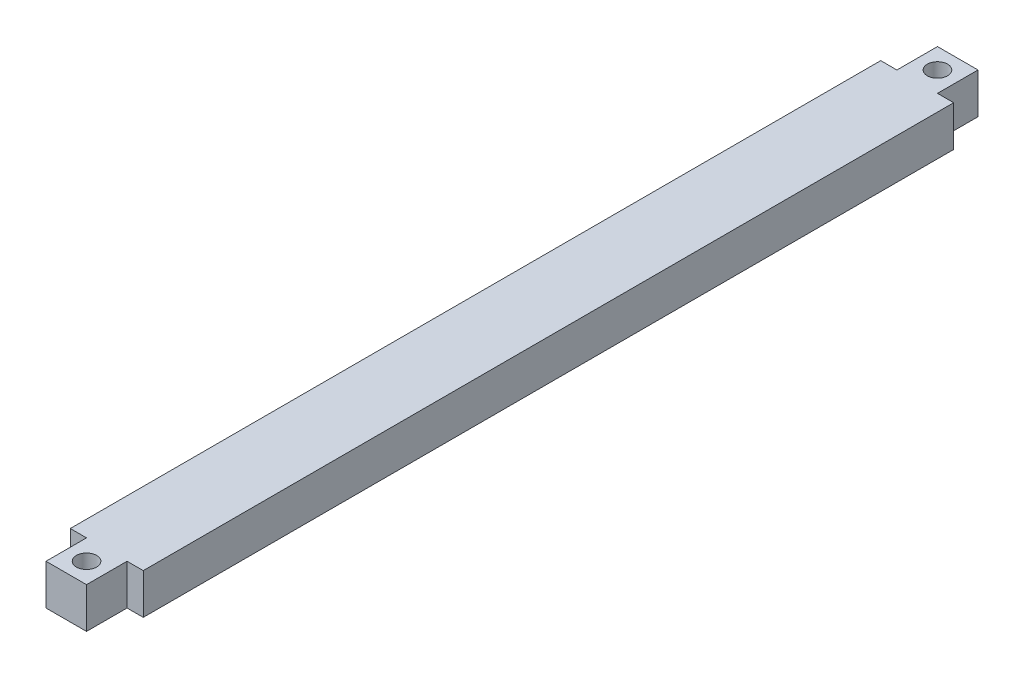
ISO-10303-21;
HEADER;
FILE_DESCRIPTION(('STEP AP214'),'2;1');
FILE_NAME('part.step','',(''),(''),'','','');
FILE_SCHEMA(('AUTOMOTIVE_DESIGN { 1 0 10303 214 1 1 1 1 }'));
ENDSEC;
DATA;
#1=APPLICATION_CONTEXT('core data for automotive mechanical design processes');
#2=APPLICATION_PROTOCOL_DEFINITION('international standard','automotive_design',2000,#1);
#3=PRODUCT_CONTEXT('',#1,'mechanical');
#4=PRODUCT('Part','Part','',(#3));
#5=PRODUCT_RELATED_PRODUCT_CATEGORY('part','',(#4));
#6=PRODUCT_DEFINITION_FORMATION('','',#4);
#7=PRODUCT_DEFINITION_CONTEXT('part definition',#1,'design');
#8=PRODUCT_DEFINITION('design','',#6,#7);
#9=PRODUCT_DEFINITION_SHAPE('','',#8);
#10=(LENGTH_UNIT() NAMED_UNIT(*) SI_UNIT(.MILLI.,.METRE.));
#11=(NAMED_UNIT(*) PLANE_ANGLE_UNIT() SI_UNIT($,.RADIAN.));
#12=(NAMED_UNIT(*) SI_UNIT($,.STERADIAN.) SOLID_ANGLE_UNIT());
#13=UNCERTAINTY_MEASURE_WITH_UNIT(LENGTH_MEASURE(1.E-05),#10,'distance_accuracy_value','');
#14=(GEOMETRIC_REPRESENTATION_CONTEXT(3) GLOBAL_UNCERTAINTY_ASSIGNED_CONTEXT((#13)) GLOBAL_UNIT_ASSIGNED_CONTEXT((#10,
#11,#12)) REPRESENTATION_CONTEXT('',''));
#15=CARTESIAN_POINT('',(0.,0.,0.));
#16=DIRECTION('',(0.,0.,1.));
#17=DIRECTION('',(1.,0.,0.));
#18=AXIS2_PLACEMENT_3D('',#15,#16,#17);
#19=CARTESIAN_POINT('',(0.438510718435152,1.01292157270844,110.));
#20=DIRECTION('',(0.,-1.,0.));
#21=DIRECTION('',(0.,0.,-1.));
#22=AXIS2_PLACEMENT_3D('',#19,#20,#21);
#23=PLANE('',#22);
#24=DIRECTION('',(-1.,0.,0.));
#25=VECTOR('',#24,1.);
#26=CARTESIAN_POINT('',(0.438510718435152,1.01292157270844,0.));
#27=LINE('',#26,#25);
#28=CARTESIAN_POINT('',(5.43851071843515,1.01292157270844,0.));
#29=VERTEX_POINT('',#28);
#30=CARTESIAN_POINT('',(0.438510718435152,1.01292157270844,0.));
#31=VERTEX_POINT('',#30);
#32=EDGE_CURVE('E209',#29,#31,#27,.T.);
#33=ORIENTED_EDGE('',*,*,#32,.T.);
#34=DIRECTION('',(0.,0.,-1.));
#35=VECTOR('',#34,1.);
#36=CARTESIAN_POINT('',(0.438510718435152,1.01292157270844,110.));
#37=LINE('',#36,#35);
#38=CARTESIAN_POINT('',(0.438510718435152,1.01292157270844,5.00908916910703));
#39=VERTEX_POINT('',#38);
#40=EDGE_CURVE('E213',#39,#31,#37,.T.);
#41=ORIENTED_EDGE('',*,*,#40,.F.);
#42=DIRECTION('',(-0.999989673535574,0.,-0.00454453762400342));
#43=VECTOR('',#42,1.);
#44=CARTESIAN_POINT('',(0.438510718435152,1.01292157270844,5.00908916910703));
#45=LINE('',#44,#43);
#46=CARTESIAN_POINT('',(-1.56148928156485,1.01292157270844,5.00000000000004));
#47=VERTEX_POINT('',#46);
#48=EDGE_CURVE('E50',#39,#47,#45,.T.);
#49=ORIENTED_EDGE('',*,*,#48,.T.);
#50=DIRECTION('',(0.,0.,1.));
#51=VECTOR('',#50,1.);
#52=CARTESIAN_POINT('',(-1.56148928156485,1.01292157270844,5.00000000000004));
#53=LINE('',#52,#51);
#54=CARTESIAN_POINT('',(-1.56148928156484,1.01292157270844,105.));
#55=VERTEX_POINT('',#54);
#56=EDGE_CURVE('E129',#47,#55,#53,.T.);
#57=ORIENTED_EDGE('',*,*,#56,.T.);
#58=DIRECTION('',(1.,0.,0.));
#59=VECTOR('',#58,1.);
#60=CARTESIAN_POINT('',(-1.56148928156484,1.01292157270844,105.));
#61=LINE('',#60,#59);
#62=CARTESIAN_POINT('',(0.438510718435152,1.01292157270844,105.));
#63=VERTEX_POINT('',#62);
#64=EDGE_CURVE('E144',#55,#63,#61,.T.);
#65=ORIENTED_EDGE('',*,*,#64,.T.);
#66=CARTESIAN_POINT('',(0.438510718435152,1.01292157270844,110.));
#67=VERTEX_POINT('',#66);
#68=EDGE_CURVE('E215',#67,#63,#37,.T.);
#69=ORIENTED_EDGE('',*,*,#68,.F.);
#70=DIRECTION('',(-1.,0.,0.));
#71=VECTOR('',#70,1.);
#72=CARTESIAN_POINT('',(0.438510718435152,1.01292157270844,110.));
#73=LINE('',#72,#71);
#74=CARTESIAN_POINT('',(5.43851071843515,1.01292157270844,110.));
#75=VERTEX_POINT('',#74);
#76=EDGE_CURVE('E221',#75,#67,#73,.T.);
#77=ORIENTED_EDGE('',*,*,#76,.F.);
#78=DIRECTION('',(0.,0.,-1.));
#79=VECTOR('',#78,1.);
#80=CARTESIAN_POINT('',(5.43851071843515,1.01292157270844,110.));
#81=LINE('',#80,#79);
#82=CARTESIAN_POINT('',(5.43851071843515,1.01292157270844,105.));
#83=VERTEX_POINT('',#82);
#84=EDGE_CURVE('E197',#75,#83,#81,.T.);
#85=ORIENTED_EDGE('',*,*,#84,.T.);
#86=DIRECTION('',(1.,0.,0.));
#87=VECTOR('',#86,1.);
#88=CARTESIAN_POINT('',(7.43851071843516,1.01292157270844,105.));
#89=LINE('',#88,#87);
#90=CARTESIAN_POINT('',(7.43851071843516,1.01292157270844,105.));
#91=VERTEX_POINT('',#90);
#92=EDGE_CURVE('E58',#83,#91,#89,.T.);
#93=ORIENTED_EDGE('',*,*,#92,.T.);
#94=DIRECTION('',(0.,0.,-1.));
#95=VECTOR('',#94,1.);
#96=CARTESIAN_POINT('',(7.43851071843515,1.01292157270844,5.00000000000004));
#97=LINE('',#96,#95);
#98=CARTESIAN_POINT('',(7.43851071843515,1.01292157270844,5.00000000000004));
#99=VERTEX_POINT('',#98);
#100=EDGE_CURVE('E167',#91,#99,#97,.T.);
#101=ORIENTED_EDGE('',*,*,#100,.T.);
#102=DIRECTION('',(-1.,0.,0.));
#103=VECTOR('',#102,1.);
#104=CARTESIAN_POINT('',(5.43851071843515,1.01292157270844,5.00000000000004));
#105=LINE('',#104,#103);
#106=CARTESIAN_POINT('',(5.43851071843515,1.01292157270844,5.00000000000004));
#107=VERTEX_POINT('',#106);
#108=EDGE_CURVE('E170',#99,#107,#105,.T.);
#109=ORIENTED_EDGE('',*,*,#108,.T.);
#110=EDGE_CURVE('E202',#107,#29,#81,.T.);
#111=ORIENTED_EDGE('',*,*,#110,.T.);
#112=EDGE_LOOP('',(#33,#41,#49,#57,#65,#69,#77,#85,#93,#101,#109,#111));
#113=FACE_BOUND('',#112,.T.);
#114=CARTESIAN_POINT('',(2.93851071843515,1.01292157270844,2.50227229227677));
#115=DIRECTION('',(0.,1.,0.));
#116=DIRECTION('',(0.,0.,1.));
#117=AXIS2_PLACEMENT_3D('',#114,#115,#116);
#118=CIRCLE('',#117,1.24999999999999);
#119=CARTESIAN_POINT('',(2.93851071843515,1.01292157270844,3.75227229227676));
#120=VERTEX_POINT('',#119);
#121=EDGE_CURVE('E272',#120,#120,#118,.T.);
#122=ORIENTED_EDGE('',*,*,#121,.F.);
#123=EDGE_LOOP('',(#122));
#124=FACE_BOUND('',#123,.T.);
#125=CARTESIAN_POINT('',(2.93851071843507,1.01292157270844,107.497727707723));
#126=DIRECTION('',(0.,1.,0.));
#127=DIRECTION('',(0.,0.,1.));
#128=AXIS2_PLACEMENT_3D('',#125,#126,#127);
#129=CIRCLE('',#128,1.24999999999999);
#130=CARTESIAN_POINT('',(2.93851071843507,1.01292157270844,108.747727707723));
#131=VERTEX_POINT('',#130);
#132=EDGE_CURVE('E283',#131,#131,#129,.T.);
#133=ORIENTED_EDGE('',*,*,#132,.F.);
#134=EDGE_LOOP('',(#133));
#135=FACE_BOUND('',#134,.T.);
#136=ADVANCED_FACE('F33',(#113,#124,#135),#23,.F.);
#137=CARTESIAN_POINT('',(0.438510718435152,1.01292157270844,110.));
#138=DIRECTION('',(1.,0.,0.));
#139=DIRECTION('',(0.,1.,0.));
#140=AXIS2_PLACEMENT_3D('',#137,#138,#139);
#141=PLANE('',#140);
#142=DIRECTION('',(0.,1.,0.));
#143=VECTOR('',#142,1.);
#144=CARTESIAN_POINT('',(0.438510718435152,-3.98707842729156,105.));
#145=LINE('',#144,#143);
#146=CARTESIAN_POINT('',(0.438510718435152,-3.98707842729156,105.));
#147=VERTEX_POINT('',#146);
#148=EDGE_CURVE('E153',#147,#63,#145,.T.);
#149=ORIENTED_EDGE('',*,*,#148,.F.);
#150=DIRECTION('',(0.,0.,-1.));
#151=VECTOR('',#150,1.);
#152=CARTESIAN_POINT('',(0.438510718435152,-3.98707842729156,110.));
#153=LINE('',#152,#151);
#154=CARTESIAN_POINT('',(0.438510718435152,-3.98707842729156,110.));
#155=VERTEX_POINT('',#154);
#156=EDGE_CURVE('E11',#155,#147,#153,.T.);
#157=ORIENTED_EDGE('',*,*,#156,.F.);
#158=DIRECTION('',(0.,-1.,0.));
#159=VECTOR('',#158,1.);
#160=CARTESIAN_POINT('',(0.438510718435152,1.01292157270844,110.));
#161=LINE('',#160,#159);
#162=EDGE_CURVE('E243',#67,#155,#161,.T.);
#163=ORIENTED_EDGE('',*,*,#162,.F.);
#164=ORIENTED_EDGE('',*,*,#68,.T.);
#165=EDGE_LOOP('',(#149,#157,#163,#164));
#166=FACE_BOUND('',#165,.T.);
#167=ADVANCED_FACE('F291',(#166),#141,.F.);
#168=CARTESIAN_POINT('',(5.43851071843515,1.01292157270844,110.));
#169=DIRECTION('',(-1.,0.,0.));
#170=DIRECTION('',(0.,0.,1.));
#171=AXIS2_PLACEMENT_3D('',#168,#169,#170);
#172=PLANE('',#171);
#173=DIRECTION('',(0.,1.,0.));
#174=VECTOR('',#173,1.);
#175=CARTESIAN_POINT('',(5.43851071843515,-3.98707842729156,5.00000000000004));
#176=LINE('',#175,#174);
#177=CARTESIAN_POINT('',(5.43851071843515,-3.98707842729156,5.00000000000004));
#178=VERTEX_POINT('',#177);
#179=EDGE_CURVE('E176',#178,#107,#176,.T.);
#180=ORIENTED_EDGE('',*,*,#179,.F.);
#181=DIRECTION('',(0.,0.,-1.));
#182=VECTOR('',#181,1.);
#183=CARTESIAN_POINT('',(5.43851071843515,-3.98707842729156,110.));
#184=LINE('',#183,#182);
#185=CARTESIAN_POINT('',(5.43851071843515,-3.98707842729156,0.));
#186=VERTEX_POINT('',#185);
#187=EDGE_CURVE('E201',#178,#186,#184,.T.);
#188=ORIENTED_EDGE('',*,*,#187,.T.);
#189=DIRECTION('',(0.,1.,0.));
#190=VECTOR('',#189,1.);
#191=CARTESIAN_POINT('',(5.43851071843515,1.01292157270844,0.));
#192=LINE('',#191,#190);
#193=EDGE_CURVE('E237',#186,#29,#192,.T.);
#194=ORIENTED_EDGE('',*,*,#193,.T.);
#195=ORIENTED_EDGE('',*,*,#110,.F.);
#196=EDGE_LOOP('',(#180,#188,#194,#195));
#197=FACE_BOUND('',#196,.T.);
#198=ADVANCED_FACE('F298',(#197),#172,.F.);
#199=CARTESIAN_POINT('',(0.438510718435152,-3.98707842729156,5.00908916910703));
#200=VERTEX_POINT('',#199);
#201=CARTESIAN_POINT('',(0.438510718435152,-3.98707842729156,0.));
#202=VERTEX_POINT('',#201);
#203=EDGE_CURVE('E42',#200,#202,#153,.T.);
#204=ORIENTED_EDGE('',*,*,#203,.F.);
#205=DIRECTION('',(0.,1.,0.));
#206=VECTOR('',#205,1.);
#207=CARTESIAN_POINT('',(0.438510718435152,-3.98707842729156,5.00908916910703));
#208=LINE('',#207,#206);
#209=EDGE_CURVE('E143',#200,#39,#208,.T.);
#210=ORIENTED_EDGE('',*,*,#209,.T.);
#211=ORIENTED_EDGE('',*,*,#40,.T.);
#212=DIRECTION('',(0.,-1.,0.));
#213=VECTOR('',#212,1.);
#214=CARTESIAN_POINT('',(0.438510718435152,1.01292157270844,0.));
#215=LINE('',#214,#213);
#216=EDGE_CURVE('E179',#31,#202,#215,.T.);
#217=ORIENTED_EDGE('',*,*,#216,.T.);
#218=EDGE_LOOP('',(#204,#210,#211,#217));
#219=FACE_BOUND('',#218,.T.);
#220=ADVANCED_FACE('F35',(#219),#141,.F.);
#221=CARTESIAN_POINT('',(0.438510718435152,-3.98707842729156,110.));
#222=DIRECTION('',(0.,1.,0.));
#223=DIRECTION('',(0.,0.,1.));
#224=AXIS2_PLACEMENT_3D('',#221,#222,#223);
#225=PLANE('',#224);
#226=CARTESIAN_POINT('',(2.93851071843507,-3.98707842729156,107.497727707723));
#227=DIRECTION('',(0.,1.,0.));
#228=DIRECTION('',(0.,0.,1.));
#229=AXIS2_PLACEMENT_3D('',#226,#227,#228);
#230=CIRCLE('',#229,1.24999999999999);
#231=CARTESIAN_POINT('',(2.93851071843507,-3.98707842729156,108.747727707723));
#232=VERTEX_POINT('',#231);
#233=EDGE_CURVE('E278',#232,#232,#230,.T.);
#234=ORIENTED_EDGE('',*,*,#233,.T.);
#235=EDGE_LOOP('',(#234));
#236=FACE_BOUND('',#235,.T.);
#237=CARTESIAN_POINT('',(2.93851071843515,-3.98707842729156,2.50227229227677));
#238=DIRECTION('',(0.,1.,0.));
#239=DIRECTION('',(0.,0.,1.));
#240=AXIS2_PLACEMENT_3D('',#237,#238,#239);
#241=CIRCLE('',#240,1.24999999999999);
#242=CARTESIAN_POINT('',(2.93851071843515,-3.98707842729156,3.75227229227676));
#243=VERTEX_POINT('',#242);
#244=EDGE_CURVE('E270',#243,#243,#241,.T.);
#245=ORIENTED_EDGE('',*,*,#244,.T.);
#246=EDGE_LOOP('',(#245));
#247=FACE_BOUND('',#246,.T.);
#248=DIRECTION('',(1.,0.,0.));
#249=VECTOR('',#248,1.);
#250=CARTESIAN_POINT('',(0.438510718435152,-3.98707842729156,0.));
#251=LINE('',#250,#249);
#252=EDGE_CURVE('E236',#202,#186,#251,.T.);
#253=ORIENTED_EDGE('',*,*,#252,.T.);
#254=ORIENTED_EDGE('',*,*,#187,.F.);
#255=DIRECTION('',(-1.,0.,0.));
#256=VECTOR('',#255,1.);
#257=CARTESIAN_POINT('',(5.43851071843515,-3.98707842729156,5.00000000000004));
#258=LINE('',#257,#256);
#259=CARTESIAN_POINT('',(7.43851071843515,-3.98707842729156,5.00000000000004));
#260=VERTEX_POINT('',#259);
#261=EDGE_CURVE('E165',#260,#178,#258,.T.);
#262=ORIENTED_EDGE('',*,*,#261,.F.);
#263=DIRECTION('',(0.,0.,-1.));
#264=VECTOR('',#263,1.);
#265=CARTESIAN_POINT('',(7.43851071843515,-3.98707842729156,5.00000000000004));
#266=LINE('',#265,#264);
#267=CARTESIAN_POINT('',(7.43851071843516,-3.98707842729156,105.));
#268=VERTEX_POINT('',#267);
#269=EDGE_CURVE('E162',#268,#260,#266,.T.);
#270=ORIENTED_EDGE('',*,*,#269,.F.);
#271=DIRECTION('',(1.,0.,0.));
#272=VECTOR('',#271,1.);
#273=CARTESIAN_POINT('',(7.43851071843516,-3.98707842729156,105.));
#274=LINE('',#273,#272);
#275=CARTESIAN_POINT('',(5.43851071843515,-3.98707842729156,105.));
#276=VERTEX_POINT('',#275);
#277=EDGE_CURVE('E166',#276,#268,#274,.T.);
#278=ORIENTED_EDGE('',*,*,#277,.F.);
#279=CARTESIAN_POINT('',(5.43851071843515,-3.98707842729156,110.));
#280=VERTEX_POINT('',#279);
#281=EDGE_CURVE('E262',#280,#276,#184,.T.);
#282=ORIENTED_EDGE('',*,*,#281,.F.);
#283=DIRECTION('',(1.,0.,0.));
#284=VECTOR('',#283,1.);
#285=CARTESIAN_POINT('',(0.438510718435152,-3.98707842729156,110.));
#286=LINE('',#285,#284);
#287=EDGE_CURVE('E231',#155,#280,#286,.T.);
#288=ORIENTED_EDGE('',*,*,#287,.F.);
#289=ORIENTED_EDGE('',*,*,#156,.T.);
#290=DIRECTION('',(1.,0.,0.));
#291=VECTOR('',#290,1.);
#292=CARTESIAN_POINT('',(-1.56148928156484,-3.98707842729156,105.));
#293=LINE('',#292,#291);
#294=CARTESIAN_POINT('',(-1.56148928156484,-3.98707842729156,105.));
#295=VERTEX_POINT('',#294);
#296=EDGE_CURVE('E132',#295,#147,#293,.T.);
#297=ORIENTED_EDGE('',*,*,#296,.F.);
#298=DIRECTION('',(0.,0.,1.));
#299=VECTOR('',#298,1.);
#300=CARTESIAN_POINT('',(-1.56148928156485,-3.98707842729156,5.00000000000004));
#301=LINE('',#300,#299);
#302=CARTESIAN_POINT('',(-1.56148928156485,-3.98707842729156,5.00000000000004));
#303=VERTEX_POINT('',#302);
#304=EDGE_CURVE('E127',#303,#295,#301,.T.);
#305=ORIENTED_EDGE('',*,*,#304,.F.);
#306=DIRECTION('',(-0.999989673535574,0.,-0.00454453762400342));
#307=VECTOR('',#306,1.);
#308=CARTESIAN_POINT('',(0.438510718435152,-3.98707842729156,5.00908916910703));
#309=LINE('',#308,#307);
#310=EDGE_CURVE('E139',#200,#303,#309,.T.);
#311=ORIENTED_EDGE('',*,*,#310,.F.);
#312=ORIENTED_EDGE('',*,*,#203,.T.);
#313=EDGE_LOOP('',(#253,#254,#262,#270,#278,#282,#288,#289,#297,#305,#311,#312));
#314=FACE_BOUND('',#313,.T.);
#315=ADVANCED_FACE('F138',(#236,#247,#314),#225,.F.);
#316=ORIENTED_EDGE('',*,*,#281,.T.);
#317=DIRECTION('',(0.,1.,0.));
#318=VECTOR('',#317,1.);
#319=CARTESIAN_POINT('',(5.43851071843515,-3.98707842729156,105.));
#320=LINE('',#319,#318);
#321=EDGE_CURVE('E183',#276,#83,#320,.T.);
#322=ORIENTED_EDGE('',*,*,#321,.T.);
#323=ORIENTED_EDGE('',*,*,#84,.F.);
#324=DIRECTION('',(0.,1.,0.));
#325=VECTOR('',#324,1.);
#326=CARTESIAN_POINT('',(5.43851071843515,1.01292157270844,110.));
#327=LINE('',#326,#325);
#328=EDGE_CURVE('E226',#280,#75,#327,.T.);
#329=ORIENTED_EDGE('',*,*,#328,.F.);
#330=EDGE_LOOP('',(#316,#322,#323,#329));
#331=FACE_BOUND('',#330,.T.);
#332=ADVANCED_FACE('F266',(#331),#172,.F.);
#333=CARTESIAN_POINT('',(0.,0.,110.));
#334=DIRECTION('',(0.,0.,1.));
#335=DIRECTION('',(1.,0.,0.));
#336=AXIS2_PLACEMENT_3D('',#333,#334,#335);
#337=PLANE('',#336);
#338=ORIENTED_EDGE('',*,*,#162,.T.);
#339=ORIENTED_EDGE('',*,*,#287,.T.);
#340=ORIENTED_EDGE('',*,*,#328,.T.);
#341=ORIENTED_EDGE('',*,*,#76,.T.);
#342=EDGE_LOOP('',(#338,#339,#340,#341));
#343=FACE_BOUND('',#342,.T.);
#344=ADVANCED_FACE('F304',(#343),#337,.T.);
#345=CARTESIAN_POINT('',(0.,0.,0.));
#346=DIRECTION('',(0.,0.,1.));
#347=DIRECTION('',(1.,0.,0.));
#348=AXIS2_PLACEMENT_3D('',#345,#346,#347);
#349=PLANE('',#348);
#350=ORIENTED_EDGE('',*,*,#216,.F.);
#351=ORIENTED_EDGE('',*,*,#32,.F.);
#352=ORIENTED_EDGE('',*,*,#193,.F.);
#353=ORIENTED_EDGE('',*,*,#252,.F.);
#354=EDGE_LOOP('',(#350,#351,#352,#353));
#355=FACE_BOUND('',#354,.T.);
#356=ADVANCED_FACE('F301',(#355),#349,.F.);
#357=CARTESIAN_POINT('',(5.43851071843515,-3.98707842729156,5.00000000000004));
#358=DIRECTION('',(0.,0.,-1.));
#359=DIRECTION('',(-1.,0.,0.));
#360=AXIS2_PLACEMENT_3D('',#357,#358,#359);
#361=PLANE('',#360);
#362=ORIENTED_EDGE('',*,*,#108,.F.);
#363=DIRECTION('',(0.,1.,0.));
#364=VECTOR('',#363,1.);
#365=CARTESIAN_POINT('',(7.43851071843515,-3.98707842729156,5.00000000000004));
#366=LINE('',#365,#364);
#367=EDGE_CURVE('E173',#260,#99,#366,.T.);
#368=ORIENTED_EDGE('',*,*,#367,.F.);
#369=ORIENTED_EDGE('',*,*,#261,.T.);
#370=ORIENTED_EDGE('',*,*,#179,.T.);
#371=EDGE_LOOP('',(#362,#368,#369,#370));
#372=FACE_BOUND('',#371,.T.);
#373=ADVANCED_FACE('F328',(#372),#361,.T.);
#374=CARTESIAN_POINT('',(7.43851071843515,-3.98707842729156,5.00000000000004));
#375=DIRECTION('',(1.,0.,0.));
#376=DIRECTION('',(0.,0.,-1.));
#377=AXIS2_PLACEMENT_3D('',#374,#375,#376);
#378=PLANE('',#377);
#379=ORIENTED_EDGE('',*,*,#100,.F.);
#380=DIRECTION('',(0.,1.,0.));
#381=VECTOR('',#380,1.);
#382=CARTESIAN_POINT('',(7.43851071843516,-3.98707842729156,105.));
#383=LINE('',#382,#381);
#384=EDGE_CURVE('E250',#268,#91,#383,.T.);
#385=ORIENTED_EDGE('',*,*,#384,.F.);
#386=ORIENTED_EDGE('',*,*,#269,.T.);
#387=ORIENTED_EDGE('',*,*,#367,.T.);
#388=EDGE_LOOP('',(#379,#385,#386,#387));
#389=FACE_BOUND('',#388,.T.);
#390=ADVANCED_FACE('F330',(#389),#378,.T.);
#391=CARTESIAN_POINT('',(7.43851071843516,-3.98707842729156,105.));
#392=DIRECTION('',(0.,0.,1.));
#393=DIRECTION('',(1.,0.,0.));
#394=AXIS2_PLACEMENT_3D('',#391,#392,#393);
#395=PLANE('',#394);
#396=ORIENTED_EDGE('',*,*,#92,.F.);
#397=ORIENTED_EDGE('',*,*,#321,.F.);
#398=ORIENTED_EDGE('',*,*,#277,.T.);
#399=ORIENTED_EDGE('',*,*,#384,.T.);
#400=EDGE_LOOP('',(#396,#397,#398,#399));
#401=FACE_BOUND('',#400,.T.);
#402=ADVANCED_FACE('F257',(#401),#395,.T.);
#403=CARTESIAN_POINT('',(0.438510718435152,-3.98707842729156,5.00908916910703));
#404=DIRECTION('',(0.00454453762400342,0.,-0.999989673535574));
#405=DIRECTION('',(-0.999989673535574,0.,-0.00454453762400342));
#406=AXIS2_PLACEMENT_3D('',#403,#404,#405);
#407=PLANE('',#406);
#408=ORIENTED_EDGE('',*,*,#48,.F.);
#409=ORIENTED_EDGE('',*,*,#209,.F.);
#410=ORIENTED_EDGE('',*,*,#310,.T.);
#411=DIRECTION('',(0.,1.,0.));
#412=VECTOR('',#411,1.);
#413=CARTESIAN_POINT('',(-1.56148928156485,-3.98707842729156,5.00000000000004));
#414=LINE('',#413,#412);
#415=EDGE_CURVE('E124',#303,#47,#414,.T.);
#416=ORIENTED_EDGE('',*,*,#415,.T.);
#417=EDGE_LOOP('',(#408,#409,#410,#416));
#418=FACE_BOUND('',#417,.T.);
#419=ADVANCED_FACE('F142',(#418),#407,.T.);
#420=CARTESIAN_POINT('',(-1.56148928156484,-3.98707842729156,105.));
#421=DIRECTION('',(0.,0.,1.));
#422=DIRECTION('',(1.,0.,0.));
#423=AXIS2_PLACEMENT_3D('',#420,#421,#422);
#424=PLANE('',#423);
#425=ORIENTED_EDGE('',*,*,#64,.F.);
#426=DIRECTION('',(0.,1.,0.));
#427=VECTOR('',#426,1.);
#428=CARTESIAN_POINT('',(-1.56148928156484,-3.98707842729156,105.));
#429=LINE('',#428,#427);
#430=EDGE_CURVE('E131',#295,#55,#429,.T.);
#431=ORIENTED_EDGE('',*,*,#430,.F.);
#432=ORIENTED_EDGE('',*,*,#296,.T.);
#433=ORIENTED_EDGE('',*,*,#148,.T.);
#434=EDGE_LOOP('',(#425,#431,#432,#433));
#435=FACE_BOUND('',#434,.T.);
#436=ADVANCED_FACE('F320',(#435),#424,.T.);
#437=CARTESIAN_POINT('',(-1.56148928156485,-3.98707842729156,5.00000000000004));
#438=DIRECTION('',(-1.,0.,0.));
#439=DIRECTION('',(0.,0.,1.));
#440=AXIS2_PLACEMENT_3D('',#437,#438,#439);
#441=PLANE('',#440);
#442=ORIENTED_EDGE('',*,*,#56,.F.);
#443=ORIENTED_EDGE('',*,*,#415,.F.);
#444=ORIENTED_EDGE('',*,*,#304,.T.);
#445=ORIENTED_EDGE('',*,*,#430,.T.);
#446=EDGE_LOOP('',(#442,#443,#444,#445));
#447=FACE_BOUND('',#446,.T.);
#448=ADVANCED_FACE('F126',(#447),#441,.T.);
#449=CARTESIAN_POINT('',(2.93851071843515,1.01292157270844,2.50227229227677));
#450=DIRECTION('',(0.,1.,0.));
#451=DIRECTION('',(0.,0.,1.));
#452=AXIS2_PLACEMENT_3D('',#449,#450,#451);
#453=CYLINDRICAL_SURFACE('',#452,1.24999999999999);
#454=ORIENTED_EDGE('',*,*,#121,.T.);
#455=EDGE_LOOP('',(#454));
#456=FACE_BOUND('',#455,.T.);
#457=ORIENTED_EDGE('',*,*,#244,.F.);
#458=EDGE_LOOP('',(#457));
#459=FACE_BOUND('',#458,.T.);
#460=ADVANCED_FACE('F312',(#456,#459),#453,.F.);
#461=CARTESIAN_POINT('',(2.93851071843507,1.01292157270844,107.497727707723));
#462=DIRECTION('',(0.,1.,0.));
#463=DIRECTION('',(0.,0.,1.));
#464=AXIS2_PLACEMENT_3D('',#461,#462,#463);
#465=CYLINDRICAL_SURFACE('',#464,1.24999999999999);
#466=ORIENTED_EDGE('',*,*,#132,.T.);
#467=EDGE_LOOP('',(#466));
#468=FACE_BOUND('',#467,.T.);
#469=ORIENTED_EDGE('',*,*,#233,.F.);
#470=EDGE_LOOP('',(#469));
#471=FACE_BOUND('',#470,.T.);
#472=ADVANCED_FACE('F287',(#468,#471),#465,.F.);
#473=CLOSED_SHELL('',(#136,#167,#198,#220,#315,#332,#344,#356,#373,#390,#402,#419,#436,#448,
#460,#472));
#474=MANIFOLD_SOLID_BREP('B2',#473);
#475=ADVANCED_BREP_SHAPE_REPRESENTATION('',(#18,#474),#14);
#476=SHAPE_DEFINITION_REPRESENTATION(#9,#475);
ENDSEC;
END-ISO-10303-21;
